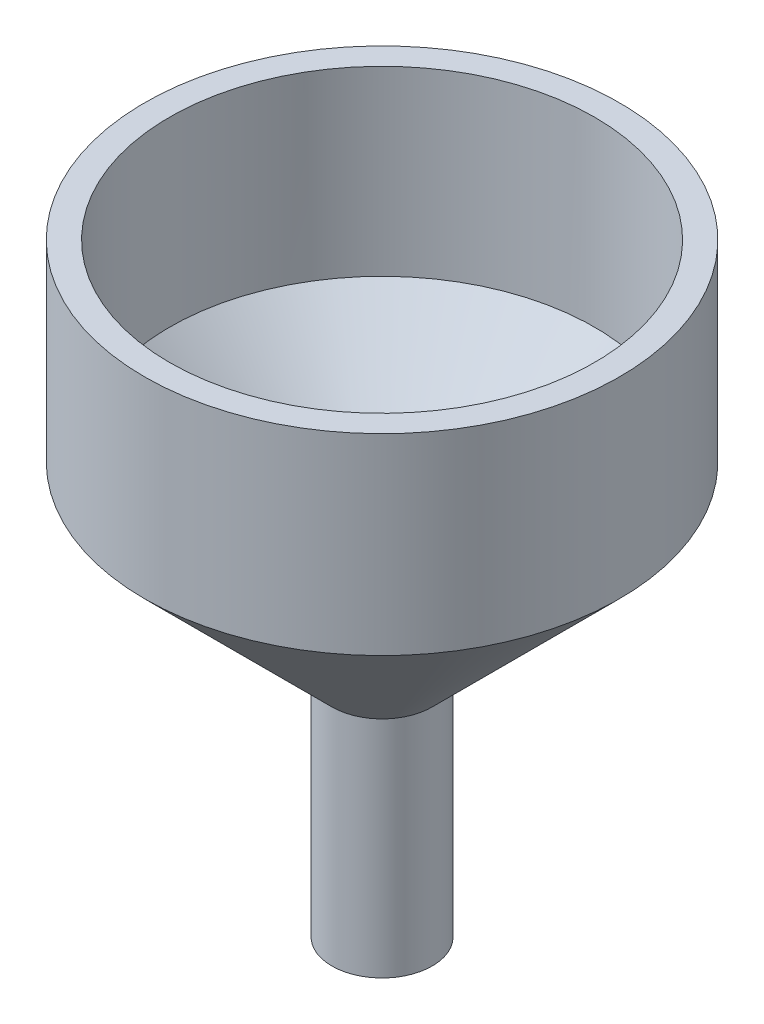
ISO-10303-21;
HEADER;
FILE_DESCRIPTION(('STEP AP214'),'2;1');
FILE_NAME('part.step','',(''),(''),'','','');
FILE_SCHEMA(('AUTOMOTIVE_DESIGN { 1 0 10303 214 1 1 1 1 }'));
ENDSEC;
DATA;
#1=APPLICATION_CONTEXT('core data for automotive mechanical design processes');
#2=APPLICATION_PROTOCOL_DEFINITION('international standard','automotive_design',2000,#1);
#3=PRODUCT_CONTEXT('',#1,'mechanical');
#4=PRODUCT('Part','Part','',(#3));
#5=PRODUCT_RELATED_PRODUCT_CATEGORY('part','',(#4));
#6=PRODUCT_DEFINITION_FORMATION('','',#4);
#7=PRODUCT_DEFINITION_CONTEXT('part definition',#1,'design');
#8=PRODUCT_DEFINITION('design','',#6,#7);
#9=PRODUCT_DEFINITION_SHAPE('','',#8);
#10=(LENGTH_UNIT() NAMED_UNIT(*) SI_UNIT(.MILLI.,.METRE.));
#11=(NAMED_UNIT(*) PLANE_ANGLE_UNIT() SI_UNIT($,.RADIAN.));
#12=(NAMED_UNIT(*) SI_UNIT($,.STERADIAN.) SOLID_ANGLE_UNIT());
#13=UNCERTAINTY_MEASURE_WITH_UNIT(LENGTH_MEASURE(1.E-05),#10,'distance_accuracy_value','');
#14=(GEOMETRIC_REPRESENTATION_CONTEXT(3) GLOBAL_UNCERTAINTY_ASSIGNED_CONTEXT((#13)) GLOBAL_UNIT_ASSIGNED_CONTEXT((#10,
#11,#12)) REPRESENTATION_CONTEXT('',''));
#15=CARTESIAN_POINT('',(0.,0.,0.));
#16=DIRECTION('',(0.,0.,1.));
#17=DIRECTION('',(1.,0.,0.));
#18=AXIS2_PLACEMENT_3D('',#15,#16,#17);
#19=CARTESIAN_POINT('',(0.,53.7162936770409,-47.6176845049114));
#20=DIRECTION('',(0.,-1.,0.));
#21=DIRECTION('',(0.,0.,-1.));
#22=AXIS2_PLACEMENT_3D('',#19,#20,#21);
#23=PLANE('',#22);
#24=CARTESIAN_POINT('',(0.,53.7162936770409,0.));
#25=DIRECTION('',(0.,-1.,0.));
#26=DIRECTION('',(0.,0.,-1.));
#27=AXIS2_PLACEMENT_3D('',#24,#25,#26);
#28=CIRCLE('',#27,42.6176845049114);
#29=CARTESIAN_POINT('',(0.,53.7162936770409,-42.6176845049114));
#30=VERTEX_POINT('',#29);
#31=EDGE_CURVE('E51',#30,#30,#28,.F.);
#32=ORIENTED_EDGE('',*,*,#31,.F.);
#33=EDGE_LOOP('',(#32));
#34=FACE_BOUND('',#33,.T.);
#35=CARTESIAN_POINT('',(0.,53.7162936770409,0.));
#36=DIRECTION('',(0.,1.,0.));
#37=DIRECTION('',(0.,0.,1.));
#38=AXIS2_PLACEMENT_3D('',#35,#36,#37);
#39=CIRCLE('',#38,47.6176845049114);
#40=CARTESIAN_POINT('',(0.,53.7162936770409,47.6176845049114));
#41=VERTEX_POINT('',#40);
#42=EDGE_CURVE('E45',#41,#41,#39,.T.);
#43=ORIENTED_EDGE('',*,*,#42,.T.);
#44=EDGE_LOOP('',(#43));
#45=FACE_BOUND('',#44,.T.);
#46=ADVANCED_FACE('F31',(#34,#45),#23,.F.);
#47=CARTESIAN_POINT('',(0.,-67.3705406132293,0.));
#48=DIRECTION('',(0.,1.,0.));
#49=DIRECTION('',(0.,0.,1.));
#50=AXIS2_PLACEMENT_3D('',#47,#48,#49);
#51=PLANE('',#50);
#52=CARTESIAN_POINT('',(0.,-67.3705406132293,0.));
#53=DIRECTION('',(0.,1.,0.));
#54=DIRECTION('',(0.,0.,1.));
#55=AXIS2_PLACEMENT_3D('',#52,#53,#54);
#56=CIRCLE('',#55,5.06753234112587);
#57=CARTESIAN_POINT('',(0.,-67.3705406132293,5.06753234112587));
#58=VERTEX_POINT('',#57);
#59=EDGE_CURVE('E50',#58,#58,#56,.T.);
#60=ORIENTED_EDGE('',*,*,#59,.T.);
#61=EDGE_LOOP('',(#60));
#62=FACE_BOUND('',#61,.T.);
#63=CARTESIAN_POINT('',(0.,-67.3705406132293,0.));
#64=DIRECTION('',(0.,1.,0.));
#65=DIRECTION('',(0.,0.,1.));
#66=AXIS2_PLACEMENT_3D('',#63,#64,#65);
#67=CIRCLE('',#66,10.0675323411259);
#68=CARTESIAN_POINT('',(0.,-67.3705406132293,10.0675323411259));
#69=VERTEX_POINT('',#68);
#70=EDGE_CURVE('E10',#69,#69,#67,.T.);
#71=ORIENTED_EDGE('',*,*,#70,.F.);
#72=EDGE_LOOP('',(#71));
#73=FACE_BOUND('',#72,.T.);
#74=ADVANCED_FACE('F80',(#62,#73),#51,.F.);
#75=CARTESIAN_POINT('',(0.,53.7162936770409,0.));
#76=DIRECTION('',(0.,1.,0.));
#77=DIRECTION('',(0.,0.,1.));
#78=AXIS2_PLACEMENT_3D('',#75,#76,#77);
#79=CYLINDRICAL_SURFACE('',#78,10.0675323411259);
#80=CARTESIAN_POINT('',(0.,-22.3765256856972,0.));
#81=DIRECTION('',(0.,1.,0.));
#82=DIRECTION('',(0.,0.,1.));
#83=AXIS2_PLACEMENT_3D('',#80,#81,#82);
#84=CIRCLE('',#83,10.0675323411259);
#85=CARTESIAN_POINT('',(0.,-22.3765256856972,10.0675323411259));
#86=VERTEX_POINT('',#85);
#87=EDGE_CURVE('E37',#86,#86,#84,.T.);
#88=ORIENTED_EDGE('',*,*,#87,.F.);
#89=EDGE_LOOP('',(#88));
#90=FACE_BOUND('',#89,.T.);
#91=ORIENTED_EDGE('',*,*,#70,.T.);
#92=EDGE_LOOP('',(#91));
#93=FACE_BOUND('',#92,.T.);
#94=ADVANCED_FACE('F85',(#90,#93),#79,.T.);
#95=CARTESIAN_POINT('',(0.,-22.3765256856972,0.));
#96=DIRECTION('',(0.,1.,0.));
#97=DIRECTION('',(0.,0.,1.));
#98=AXIS2_PLACEMENT_3D('',#95,#96,#97);
#99=CONICAL_SURFACE('',#98,10.0675323411259,0.785398163397436);
#100=CARTESIAN_POINT('',(0.,15.1736264780892,0.));
#101=DIRECTION('',(0.,1.,0.));
#102=DIRECTION('',(0.,0.,1.));
#103=AXIS2_PLACEMENT_3D('',#100,#101,#102);
#104=CIRCLE('',#103,47.6176845049114);
#105=CARTESIAN_POINT('',(0.,15.1736264780892,47.6176845049114));
#106=VERTEX_POINT('',#105);
#107=EDGE_CURVE('E41',#106,#106,#104,.T.);
#108=CARTESIAN_POINT('',(0.,15.1736264780892,47.6176845049114));
#109=CARTESIAN_POINT('',(0.,14.7824790597165,47.2265370865386));
#110=CARTESIAN_POINT('',(0.,14.3913316413437,46.8353896681659));
#111=CARTESIAN_POINT('',(0.,13.6090368045981,46.0530948314203));
#112=CARTESIAN_POINT('',(0.,13.2178893862254,45.6619474130476));
#113=CARTESIAN_POINT('',(0.,12.4355945494798,44.879652576302));
#114=CARTESIAN_POINT('',(0.,12.044447131107,44.4885051579293));
#115=CARTESIAN_POINT('',(0.,11.2621522943615,43.7062103211837));
#116=CARTESIAN_POINT('',(0.,10.8710048759887,43.315062902811));
#117=CARTESIAN_POINT('',(0.,10.0887100392432,42.5327680660654));
#118=CARTESIAN_POINT('',(0.,9.69756262087038,42.1416206476927));
#119=CARTESIAN_POINT('',(0.,8.91526778412483,41.3593258109471));
#120=CARTESIAN_POINT('',(0.,8.52412036575205,40.9681783925744));
#121=CARTESIAN_POINT('',(0.,7.7418255290065,40.1858835558288));
#122=CARTESIAN_POINT('',(0.,7.35067811063373,39.7947361374561));
#123=CARTESIAN_POINT('',(0.,6.56838327388818,39.0124413007105));
#124=CARTESIAN_POINT('',(0.,6.1772358555154,38.6212938823378));
#125=CARTESIAN_POINT('',(0.,5.39494101876985,37.8389990455923));
#126=CARTESIAN_POINT('',(0.,5.00379360039708,37.4478516272195));
#127=CARTESIAN_POINT('',(0.,4.22149876365152,36.6655567904739));
#128=CARTESIAN_POINT('',(0.,3.83035134527875,36.2744093721012));
#129=CARTESIAN_POINT('',(0.,3.0480565085332,35.4921145353557));
#130=CARTESIAN_POINT('',(0.,2.65690909016042,35.1009671169829));
#131=CARTESIAN_POINT('',(0.,1.87461425341487,34.3186722802374));
#132=CARTESIAN_POINT('',(0.,1.48346683504209,33.9275248618646));
#133=CARTESIAN_POINT('',(0.,0.701171998296542,33.1452300251191));
#134=CARTESIAN_POINT('',(0.,0.310024579923768,32.7540826067463));
#135=CARTESIAN_POINT('',(0.,-0.472270256821783,31.9717877700008));
#136=CARTESIAN_POINT('',(0.,-0.863417675194558,31.580640351628));
#137=CARTESIAN_POINT('',(0.,-1.64571251194011,30.7983455148825));
#138=CARTESIAN_POINT('',(0.,-2.03685993031288,30.4071980965097));
#139=CARTESIAN_POINT('',(0.,-2.81915476705843,29.6249032597642));
#140=CARTESIAN_POINT('',(0.,-3.21030218543121,29.2337558413914));
#141=CARTESIAN_POINT('',(0.,-3.99259702217676,28.4514610046459));
#142=CARTESIAN_POINT('',(0.,-4.38374444054954,28.0603135862731));
#143=CARTESIAN_POINT('',(0.,-5.16603927729509,27.2780187495276));
#144=CARTESIAN_POINT('',(0.,-5.55718669566786,26.8868713311548));
#145=CARTESIAN_POINT('',(0.,-6.33948153241341,26.1045764944093));
#146=CARTESIAN_POINT('',(0.,-6.73062895078619,25.7134290760365));
#147=CARTESIAN_POINT('',(0.,-7.51292378753174,24.931134239291));
#148=CARTESIAN_POINT('',(0.,-7.90407120590451,24.5399868209182));
#149=CARTESIAN_POINT('',(0.,-8.68636604265007,23.7576919841727));
#150=CARTESIAN_POINT('',(0.,-9.07751346102284,23.3665445657999));
#151=CARTESIAN_POINT('',(0.,-9.85980829776839,22.5842497290544));
#152=CARTESIAN_POINT('',(0.,-10.2509557161412,22.1931023106816));
#153=CARTESIAN_POINT('',(0.,-11.0332505528867,21.4108074739361));
#154=CARTESIAN_POINT('',(0.,-11.4243979712595,21.0196600555633));
#155=CARTESIAN_POINT('',(0.,-12.206692808005,20.2373652188178));
#156=CARTESIAN_POINT('',(0.,-12.5978402263778,19.846217800445));
#157=CARTESIAN_POINT('',(0.,-13.3801350631234,19.0639229636995));
#158=CARTESIAN_POINT('',(0.,-13.7712824814961,18.6727755453267));
#159=CARTESIAN_POINT('',(0.,-14.5535773182417,17.8904807085812));
#160=CARTESIAN_POINT('',(0.,-14.9447247366145,17.4993332902084));
#161=CARTESIAN_POINT('',(0.,-15.72701957336,16.7170384534629));
#162=CARTESIAN_POINT('',(0.,-16.1181669917328,16.3258910350901));
#163=CARTESIAN_POINT('',(0.,-16.9004618284784,15.5435961983446));
#164=CARTESIAN_POINT('',(0.,-17.2916092468511,15.1524487799718));
#165=CARTESIAN_POINT('',(0.,-18.0739040835967,14.3701539432263));
#166=CARTESIAN_POINT('',(0.,-18.4650515019695,13.9790065248535));
#167=CARTESIAN_POINT('',(0.,-19.247346338715,13.196711688108));
#168=CARTESIAN_POINT('',(0.,-19.6384937570878,12.8055642697352));
#169=CARTESIAN_POINT('',(0.,-20.4207885938333,12.0232694329897));
#170=CARTESIAN_POINT('',(0.,-20.8119360122061,11.6321220146169));
#171=CARTESIAN_POINT('',(0.,-21.5942308489517,10.8498271778714));
#172=CARTESIAN_POINT('',(0.,-21.9853782673244,10.4586797594986));
#173=CARTESIAN_POINT('',(0.,-22.3765256856972,10.0675323411259));
#174=B_SPLINE_CURVE_WITH_KNOTS('',3,(#108,#109,#110,#111,#112,#113,#114,#115,#116,#117,#118,
#119,#120,#121,#122,#123,#124,#125,#126,#127,#128,#129,#130,#131,#132,#133,#134,#135,#136,#137,
#138,#139,#140,#141,#142,#143,#144,#145,#146,#147,#148,#149,#150,#151,#152,#153,#154,#155,#156,
#157,#158,#159,#160,#161,#162,#163,#164,#165,#166,#167,#168,#169,#170,#171,#172,#173),
.UNSPECIFIED.,.F.,.F.,(4,2,2,2,2,2,2,2,2,2,2,2,2,2,2,2,2,2,2,2,2,2,2,2,2,2,2,2,2,2,2,2,4),(0.,
1.65949795184998,3.31899590369997,4.97849385554995,6.63799180739994,8.29748975924993,
9.95698771109992,11.6164856629499,13.2759836147999,14.9354815666499,16.5949795184999,
18.2544774703499,19.9139754221998,21.5734733740498,23.2329713258998,24.8924692777498,
26.5519672295998,28.2114651814498,29.8709631332998,31.5304610851497,33.1899590369997,
34.8494569888497,36.5089549406997,38.1684528925497,39.8279508443997,41.4874487962497,
43.1469467480996,44.8064446999496,46.4659426517996,48.1254406036496,49.7849385554996,
51.4444365073496,53.1039344591995),.UNSPECIFIED.);
#175=EDGE_CURVE('BSEAM93',#106,#86,#174,.T.);
#176=ORIENTED_EDGE('',*,*,#107,.F.);
#177=ORIENTED_EDGE('',*,*,#87,.T.);
#178=ORIENTED_EDGE('',*,*,#175,.T.);
#179=ORIENTED_EDGE('',*,*,#175,.F.);
#180=EDGE_LOOP('',(#176,#178,#177,#179));
#181=FACE_BOUND('',#180,.T.);
#182=ADVANCED_FACE('F93',(#181),#99,.T.);
#183=CARTESIAN_POINT('',(0.,53.7162936770409,0.));
#184=DIRECTION('',(0.,1.,0.));
#185=DIRECTION('',(0.,0.,1.));
#186=AXIS2_PLACEMENT_3D('',#183,#184,#185);
#187=CYLINDRICAL_SURFACE('',#186,47.6176845049114);
#188=ORIENTED_EDGE('',*,*,#42,.F.);
#189=EDGE_LOOP('',(#188));
#190=FACE_BOUND('',#189,.T.);
#191=ORIENTED_EDGE('',*,*,#107,.T.);
#192=EDGE_LOOP('',(#191));
#193=FACE_BOUND('',#192,.T.);
#194=ADVANCED_FACE('F77',(#190,#193),#187,.T.);
#195=CARTESIAN_POINT('',(0.,53.7162936770409,0.));
#196=DIRECTION('',(0.,1.,0.));
#197=DIRECTION('',(0.,0.,1.));
#198=AXIS2_PLACEMENT_3D('',#195,#196,#197);
#199=CYLINDRICAL_SURFACE('',#198,5.06753234112587);
#200=CARTESIAN_POINT('',(0.,-20.3054578738318,0.));
#201=DIRECTION('',(0.,1.,0.));
#202=DIRECTION('',(0.,0.,1.));
#203=AXIS2_PLACEMENT_3D('',#200,#201,#202);
#204=CIRCLE('',#203,5.06753234112587);
#205=CARTESIAN_POINT('',(0.,-20.3054578738318,5.06753234112587));
#206=VERTEX_POINT('',#205);
#207=EDGE_CURVE('E57',#206,#206,#204,.T.);
#208=ORIENTED_EDGE('',*,*,#207,.T.);
#209=EDGE_LOOP('',(#208));
#210=FACE_BOUND('',#209,.T.);
#211=ORIENTED_EDGE('',*,*,#59,.F.);
#212=EDGE_LOOP('',(#211));
#213=FACE_BOUND('',#212,.T.);
#214=ADVANCED_FACE('F63',(#210,#213),#199,.F.);
#215=CARTESIAN_POINT('',(0.,-18.8409917797645,0.));
#216=DIRECTION('',(0.,1.,0.));
#217=DIRECTION('',(0.,0.,1.));
#218=AXIS2_PLACEMENT_3D('',#215,#216,#217);
#219=CONICAL_SURFACE('',#218,6.53199843519309,0.785398163397436);
#220=CARTESIAN_POINT('',(0.,17.2446942899547,0.));
#221=DIRECTION('',(0.,1.,0.));
#222=DIRECTION('',(0.,0.,1.));
#223=AXIS2_PLACEMENT_3D('',#220,#221,#222);
#224=CIRCLE('',#223,42.6176845049114);
#225=CARTESIAN_POINT('',(0.,17.2446942899547,42.6176845049114));
#226=VERTEX_POINT('',#225);
#227=EDGE_CURVE('E54',#226,#226,#224,.T.);
#228=CARTESIAN_POINT('',(0.,17.2446942899547,42.6176845049114));
#229=CARTESIAN_POINT('',(0.,16.8535468715819,42.2265370865386));
#230=CARTESIAN_POINT('',(0.,16.4623994532091,41.8353896681659));
#231=CARTESIAN_POINT('',(0.,15.6801046164636,41.0530948314203));
#232=CARTESIAN_POINT('',(0.,15.2889571980908,40.6619474130476));
#233=CARTESIAN_POINT('',(0.,14.5066623613453,39.879652576302));
#234=CARTESIAN_POINT('',(0.,14.1155149429725,39.4885051579293));
#235=CARTESIAN_POINT('',(0.,13.3332201062269,38.7062103211837));
#236=CARTESIAN_POINT('',(0.,12.9420726878542,38.315062902811));
#237=CARTESIAN_POINT('',(0.,12.1597778511086,37.5327680660654));
#238=CARTESIAN_POINT('',(0.,11.7686304327358,37.1416206476927));
#239=CARTESIAN_POINT('',(0.,10.9863355959903,36.3593258109471));
#240=CARTESIAN_POINT('',(0.,10.5951881776175,35.9681783925744));
#241=CARTESIAN_POINT('',(0.,9.81289334087194,35.1858835558289));
#242=CARTESIAN_POINT('',(0.,9.42174592249917,34.7947361374561));
#243=CARTESIAN_POINT('',(0.,8.63945108575362,34.0124413007105));
#244=CARTESIAN_POINT('',(0.,8.24830366738084,33.6212938823378));
#245=CARTESIAN_POINT('',(0.,7.46600883063529,32.8389990455923));
#246=CARTESIAN_POINT('',(0.,7.07486141226251,32.4478516272195));
#247=CARTESIAN_POINT('',(0.,6.29256657551696,31.665556790474));
#248=CARTESIAN_POINT('',(0.,5.90141915714419,31.2744093721012));
#249=CARTESIAN_POINT('',(0.,5.11912432039864,30.4921145353557));
#250=CARTESIAN_POINT('',(0.,4.72797690202586,30.1009671169829));
#251=CARTESIAN_POINT('',(0.,3.94568206528031,29.3186722802374));
#252=CARTESIAN_POINT('',(0.,3.55453464690754,28.9275248618646));
#253=CARTESIAN_POINT('',(0.,2.77223981016199,28.1452300251191));
#254=CARTESIAN_POINT('',(0.,2.38109239178921,27.7540826067463));
#255=CARTESIAN_POINT('',(0.,1.59879755504366,26.9717877700008));
#256=CARTESIAN_POINT('',(0.,1.20765013667088,26.580640351628));
#257=CARTESIAN_POINT('',(0.,0.42535529992533,25.7983455148825));
#258=CARTESIAN_POINT('',(0.,0.0342078815525549,25.4071980965097));
#259=CARTESIAN_POINT('',(0.,-0.748086955192996,24.6249032597642));
#260=CARTESIAN_POINT('',(0.,-1.13923437356577,24.2337558413914));
#261=CARTESIAN_POINT('',(0.,-1.92152921031132,23.4514610046459));
#262=CARTESIAN_POINT('',(0.,-2.3126766286841,23.0603135862731));
#263=CARTESIAN_POINT('',(0.,-3.09497146542965,22.2780187495276));
#264=CARTESIAN_POINT('',(0.,-3.48611888380242,21.8868713311548));
#265=CARTESIAN_POINT('',(0.,-4.26841372054797,21.1045764944093));
#266=CARTESIAN_POINT('',(0.,-4.65956113892075,20.7134290760365));
#267=CARTESIAN_POINT('',(0.,-5.4418559756663,19.931134239291));
#268=CARTESIAN_POINT('',(0.,-5.83300339403908,19.5399868209182));
#269=CARTESIAN_POINT('',(0.,-6.61529823078463,18.7576919841727));
#270=CARTESIAN_POINT('',(0.,-7.0064456491574,18.3665445657999));
#271=CARTESIAN_POINT('',(0.,-7.78874048590296,17.5842497290544));
#272=CARTESIAN_POINT('',(0.,-8.17988790427573,17.1931023106816));
#273=CARTESIAN_POINT('',(0.,-8.96218274102128,16.4108074739361));
#274=CARTESIAN_POINT('',(0.,-9.35333015939406,16.0196600555633));
#275=CARTESIAN_POINT('',(0.,-10.1356249961396,15.2373652188178));
#276=CARTESIAN_POINT('',(0.,-10.5267724145124,14.846217800445));
#277=CARTESIAN_POINT('',(0.,-11.3090672512579,14.0639229636995));
#278=CARTESIAN_POINT('',(0.,-11.7002146696307,13.6727755453267));
#279=CARTESIAN_POINT('',(0.,-12.4825095063763,12.8904807085812));
#280=CARTESIAN_POINT('',(0.,-12.873656924749,12.4993332902084));
#281=CARTESIAN_POINT('',(0.,-13.6559517614946,11.7170384534629));
#282=CARTESIAN_POINT('',(0.,-14.0470991798674,11.3258910350901));
#283=CARTESIAN_POINT('',(0.,-14.8293940166129,10.5435961983446));
#284=CARTESIAN_POINT('',(0.,-15.2205414349857,10.1524487799718));
#285=CARTESIAN_POINT('',(0.,-16.0028362717312,9.37015394322629));
#286=CARTESIAN_POINT('',(0.,-16.393983690104,8.97900652485352));
#287=CARTESIAN_POINT('',(0.,-17.1762785268496,8.19671168810799));
#288=CARTESIAN_POINT('',(0.,-17.5674259452223,7.80556426973522));
#289=CARTESIAN_POINT('',(0.,-18.3497207819679,7.02326943298969));
#290=CARTESIAN_POINT('',(0.,-18.7408682003407,6.63212201461693));
#291=CARTESIAN_POINT('',(0.,-19.5231630370862,5.8498271778714));
#292=CARTESIAN_POINT('',(0.,-19.914310455459,5.45867975949863));
#293=CARTESIAN_POINT('',(0.,-20.3054578738318,5.06753234112586));
#294=B_SPLINE_CURVE_WITH_KNOTS('',3,(#228,#229,#230,#231,#232,#233,#234,#235,#236,#237,#238,
#239,#240,#241,#242,#243,#244,#245,#246,#247,#248,#249,#250,#251,#252,#253,#254,#255,#256,#257,
#258,#259,#260,#261,#262,#263,#264,#265,#266,#267,#268,#269,#270,#271,#272,#273,#274,#275,#276,
#277,#278,#279,#280,#281,#282,#283,#284,#285,#286,#287,#288,#289,#290,#291,#292,#293),
.UNSPECIFIED.,.F.,.F.,(4,2,2,2,2,2,2,2,2,2,2,2,2,2,2,2,2,2,2,2,2,2,2,2,2,2,2,2,2,2,2,2,4),(0.,
1.65949795184999,3.31899590369997,4.97849385554996,6.63799180739995,8.29748975924993,
9.95698771109992,11.6164856629499,13.2759836147999,14.9354815666499,16.5949795184999,
18.2544774703499,19.9139754221998,21.5734733740498,23.2329713258998,24.8924692777498,
26.5519672295998,28.2114651814498,29.8709631332998,31.5304610851498,33.1899590369997,
34.8494569888497,36.5089549406997,38.1684528925497,39.8279508443997,41.4874487962497,
43.1469467480997,44.8064446999496,46.4659426517996,48.1254406036496,49.7849385554996,
51.4444365073496,53.1039344591996),.UNSPECIFIED.);
#295=EDGE_CURVE('BSEAM66',#226,#206,#294,.T.);
#296=ORIENTED_EDGE('',*,*,#227,.T.);
#297=ORIENTED_EDGE('',*,*,#207,.F.);
#298=ORIENTED_EDGE('',*,*,#295,.T.);
#299=ORIENTED_EDGE('',*,*,#295,.F.);
#300=EDGE_LOOP('',(#296,#298,#297,#299));
#301=FACE_BOUND('',#300,.T.);
#302=ADVANCED_FACE('F66',(#301),#219,.F.);
#303=CARTESIAN_POINT('',(0.,53.7162936770409,0.));
#304=DIRECTION('',(0.,1.,0.));
#305=DIRECTION('',(0.,0.,1.));
#306=AXIS2_PLACEMENT_3D('',#303,#304,#305);
#307=CYLINDRICAL_SURFACE('',#306,42.6176845049114);
#308=ORIENTED_EDGE('',*,*,#31,.T.);
#309=EDGE_LOOP('',(#308));
#310=FACE_BOUND('',#309,.T.);
#311=ORIENTED_EDGE('',*,*,#227,.F.);
#312=EDGE_LOOP('',(#311));
#313=FACE_BOUND('',#312,.T.);
#314=ADVANCED_FACE('F68',(#310,#313),#307,.F.);
#315=CLOSED_SHELL('',(#46,#74,#94,#182,#194,#214,#302,#314));
#316=MANIFOLD_SOLID_BREP('B2',#315);
#317=ADVANCED_BREP_SHAPE_REPRESENTATION('',(#18,#316),#14);
#318=SHAPE_DEFINITION_REPRESENTATION(#9,#317);
ENDSEC;
END-ISO-10303-21;
